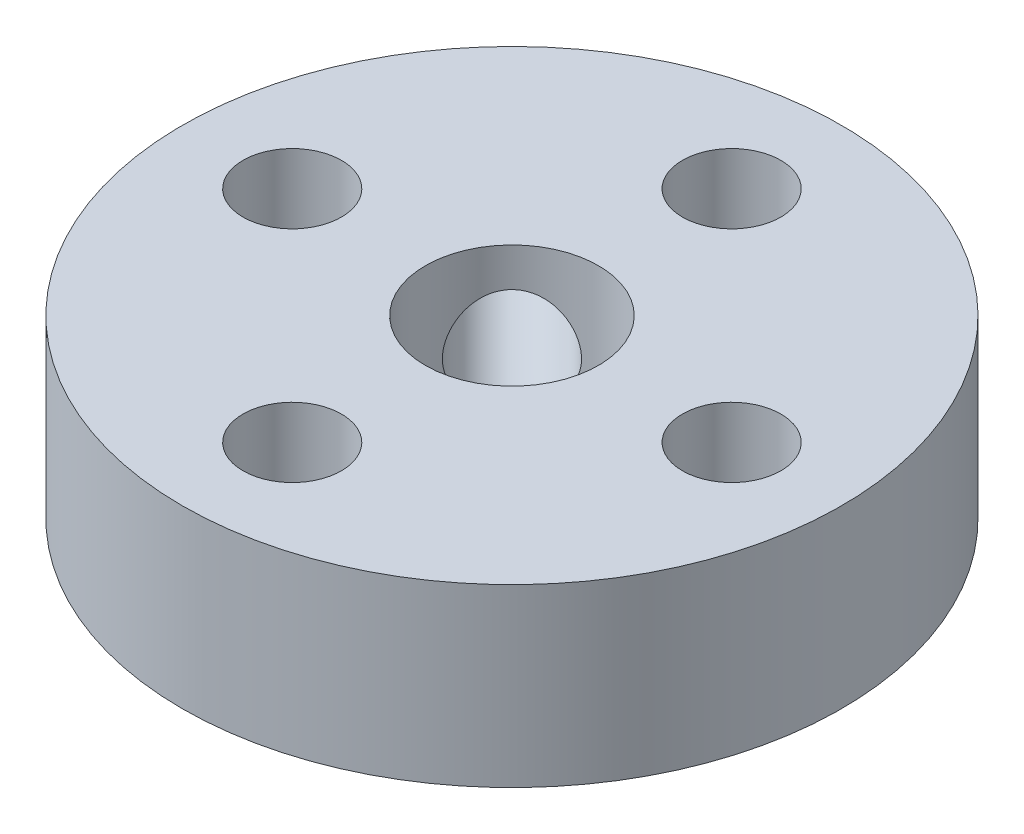
ISO-10303-21;
HEADER;
FILE_DESCRIPTION(('STEP AP214'),'2;1');
FILE_NAME('part.step','',(''),(''),'','','');
FILE_SCHEMA(('AUTOMOTIVE_DESIGN { 1 0 10303 214 1 1 1 1 }'));
ENDSEC;
DATA;
#1=APPLICATION_CONTEXT('core data for automotive mechanical design processes');
#2=APPLICATION_PROTOCOL_DEFINITION('international standard','automotive_design',2000,#1);
#3=PRODUCT_CONTEXT('',#1,'mechanical');
#4=PRODUCT('Part','Part','',(#3));
#5=PRODUCT_RELATED_PRODUCT_CATEGORY('part','',(#4));
#6=PRODUCT_DEFINITION_FORMATION('','',#4);
#7=PRODUCT_DEFINITION_CONTEXT('part definition',#1,'design');
#8=PRODUCT_DEFINITION('design','',#6,#7);
#9=PRODUCT_DEFINITION_SHAPE('','',#8);
#10=(LENGTH_UNIT() NAMED_UNIT(*) SI_UNIT(.MILLI.,.METRE.));
#11=(NAMED_UNIT(*) PLANE_ANGLE_UNIT() SI_UNIT($,.RADIAN.));
#12=(NAMED_UNIT(*) SI_UNIT($,.STERADIAN.) SOLID_ANGLE_UNIT());
#13=UNCERTAINTY_MEASURE_WITH_UNIT(LENGTH_MEASURE(1.E-05),#10,'distance_accuracy_value','');
#14=(GEOMETRIC_REPRESENTATION_CONTEXT(3) GLOBAL_UNCERTAINTY_ASSIGNED_CONTEXT((#13)) GLOBAL_UNIT_ASSIGNED_CONTEXT((#10,
#11,#12)) REPRESENTATION_CONTEXT('',''));
#15=CARTESIAN_POINT('',(0.,0.,0.));
#16=DIRECTION('',(0.,0.,1.));
#17=DIRECTION('',(1.,0.,0.));
#18=AXIS2_PLACEMENT_3D('',#15,#16,#17);
#19=CARTESIAN_POINT('',(0.,5.08,0.));
#20=DIRECTION('',(0.,1.,0.));
#21=DIRECTION('',(0.,0.,1.));
#22=AXIS2_PLACEMENT_3D('',#19,#20,#21);
#23=PLANE('',#22);
#24=CARTESIAN_POINT('',(0.,5.08,6.35));
#25=DIRECTION('',(0.,1.,0.));
#26=DIRECTION('',(0.,0.,1.));
#27=AXIS2_PLACEMENT_3D('',#24,#25,#26);
#28=CIRCLE('',#27,1.4224);
#29=CARTESIAN_POINT('',(0.,5.08,7.7724));
#30=VERTEX_POINT('',#29);
#31=EDGE_CURVE('E58',#30,#30,#28,.T.);
#32=ORIENTED_EDGE('',*,*,#31,.F.);
#33=EDGE_LOOP('',(#32));
#34=FACE_BOUND('',#33,.T.);
#35=CARTESIAN_POINT('',(0.,5.08,0.));
#36=DIRECTION('',(0.,1.,0.));
#37=DIRECTION('',(0.,0.,1.));
#38=AXIS2_PLACEMENT_3D('',#35,#36,#37);
#39=CIRCLE('',#38,2.5);
#40=CARTESIAN_POINT('',(0.,5.08,2.5));
#41=VERTEX_POINT('',#40);
#42=EDGE_CURVE('E46',#41,#41,#39,.T.);
#43=ORIENTED_EDGE('',*,*,#42,.F.);
#44=EDGE_LOOP('',(#43));
#45=FACE_BOUND('',#44,.T.);
#46=CARTESIAN_POINT('',(0.,5.08,0.));
#47=DIRECTION('',(0.,1.,0.));
#48=DIRECTION('',(0.,0.,1.));
#49=AXIS2_PLACEMENT_3D('',#46,#47,#48);
#50=CIRCLE('',#49,9.525);
#51=CARTESIAN_POINT('',(0.,5.08,9.525));
#52=VERTEX_POINT('',#51);
#53=EDGE_CURVE('E10',#52,#52,#50,.T.);
#54=ORIENTED_EDGE('',*,*,#53,.T.);
#55=EDGE_LOOP('',(#54));
#56=FACE_BOUND('',#55,.T.);
#57=CARTESIAN_POINT('',(0.,5.08,-6.35));
#58=DIRECTION('',(0.,1.,0.));
#59=DIRECTION('',(0.,0.,1.));
#60=AXIS2_PLACEMENT_3D('',#57,#58,#59);
#61=CIRCLE('',#60,1.4224);
#62=CARTESIAN_POINT('',(0.,5.08,-4.9276));
#63=VERTEX_POINT('',#62);
#64=EDGE_CURVE('E41',#63,#63,#61,.T.);
#65=ORIENTED_EDGE('',*,*,#64,.F.);
#66=EDGE_LOOP('',(#65));
#67=FACE_BOUND('',#66,.T.);
#68=CARTESIAN_POINT('',(6.35,5.08,0.));
#69=DIRECTION('',(0.,1.,0.));
#70=DIRECTION('',(0.,0.,1.));
#71=AXIS2_PLACEMENT_3D('',#68,#69,#70);
#72=CIRCLE('',#71,1.4224);
#73=CARTESIAN_POINT('',(6.35,5.08,1.4224));
#74=VERTEX_POINT('',#73);
#75=EDGE_CURVE('E52',#74,#74,#72,.T.);
#76=ORIENTED_EDGE('',*,*,#75,.F.);
#77=EDGE_LOOP('',(#76));
#78=FACE_BOUND('',#77,.T.);
#79=CARTESIAN_POINT('',(-6.35,5.08,0.));
#80=DIRECTION('',(0.,1.,0.));
#81=DIRECTION('',(0.,0.,1.));
#82=AXIS2_PLACEMENT_3D('',#79,#80,#81);
#83=CIRCLE('',#82,1.4224);
#84=CARTESIAN_POINT('',(-6.35,5.08,1.4224));
#85=VERTEX_POINT('',#84);
#86=EDGE_CURVE('E64',#85,#85,#83,.T.);
#87=ORIENTED_EDGE('',*,*,#86,.F.);
#88=EDGE_LOOP('',(#87));
#89=FACE_BOUND('',#88,.T.);
#90=ADVANCED_FACE('F30',(#34,#45,#56,#67,#78,#89),#23,.T.);
#91=CARTESIAN_POINT('',(0.,0.,0.));
#92=DIRECTION('',(0.,1.,0.));
#93=DIRECTION('',(0.,0.,1.));
#94=AXIS2_PLACEMENT_3D('',#91,#92,#93);
#95=PLANE('',#94);
#96=CARTESIAN_POINT('',(0.,0.,6.35));
#97=DIRECTION('',(0.,1.,0.));
#98=DIRECTION('',(0.,0.,1.));
#99=AXIS2_PLACEMENT_3D('',#96,#97,#98);
#100=CIRCLE('',#99,1.4224);
#101=CARTESIAN_POINT('',(0.,0.,7.7724));
#102=VERTEX_POINT('',#101);
#103=EDGE_CURVE('E61',#102,#102,#100,.T.);
#104=ORIENTED_EDGE('',*,*,#103,.T.);
#105=EDGE_LOOP('',(#104));
#106=FACE_BOUND('',#105,.T.);
#107=CARTESIAN_POINT('',(0.,0.,0.));
#108=DIRECTION('',(0.,1.,0.));
#109=DIRECTION('',(0.,0.,1.));
#110=AXIS2_PLACEMENT_3D('',#107,#108,#109);
#111=CIRCLE('',#110,2.5);
#112=CARTESIAN_POINT('',(0.,0.,2.5));
#113=VERTEX_POINT('',#112);
#114=EDGE_CURVE('E49',#113,#113,#111,.T.);
#115=ORIENTED_EDGE('',*,*,#114,.T.);
#116=EDGE_LOOP('',(#115));
#117=FACE_BOUND('',#116,.T.);
#118=CARTESIAN_POINT('',(0.,0.,0.));
#119=DIRECTION('',(0.,1.,0.));
#120=DIRECTION('',(0.,0.,1.));
#121=AXIS2_PLACEMENT_3D('',#118,#119,#120);
#122=CIRCLE('',#121,9.525);
#123=CARTESIAN_POINT('',(0.,0.,9.525));
#124=VERTEX_POINT('',#123);
#125=EDGE_CURVE('E34',#124,#124,#122,.T.);
#126=ORIENTED_EDGE('',*,*,#125,.F.);
#127=EDGE_LOOP('',(#126));
#128=FACE_BOUND('',#127,.T.);
#129=CARTESIAN_POINT('',(0.,0.,-6.35));
#130=DIRECTION('',(0.,1.,0.));
#131=DIRECTION('',(0.,0.,1.));
#132=AXIS2_PLACEMENT_3D('',#129,#130,#131);
#133=CIRCLE('',#132,1.4224);
#134=CARTESIAN_POINT('',(0.,0.,-4.9276));
#135=VERTEX_POINT('',#134);
#136=EDGE_CURVE('E43',#135,#135,#133,.T.);
#137=ORIENTED_EDGE('',*,*,#136,.T.);
#138=EDGE_LOOP('',(#137));
#139=FACE_BOUND('',#138,.T.);
#140=CARTESIAN_POINT('',(6.35,0.,0.));
#141=DIRECTION('',(0.,1.,0.));
#142=DIRECTION('',(0.,0.,1.));
#143=AXIS2_PLACEMENT_3D('',#140,#141,#142);
#144=CIRCLE('',#143,1.4224);
#145=CARTESIAN_POINT('',(6.35,0.,1.4224));
#146=VERTEX_POINT('',#145);
#147=EDGE_CURVE('E55',#146,#146,#144,.T.);
#148=ORIENTED_EDGE('',*,*,#147,.T.);
#149=EDGE_LOOP('',(#148));
#150=FACE_BOUND('',#149,.T.);
#151=CARTESIAN_POINT('',(-6.35,0.,0.));
#152=DIRECTION('',(0.,1.,0.));
#153=DIRECTION('',(0.,0.,1.));
#154=AXIS2_PLACEMENT_3D('',#151,#152,#153);
#155=CIRCLE('',#154,1.4224);
#156=CARTESIAN_POINT('',(-6.35,0.,1.4224));
#157=VERTEX_POINT('',#156);
#158=EDGE_CURVE('E67',#157,#157,#155,.T.);
#159=ORIENTED_EDGE('',*,*,#158,.T.);
#160=EDGE_LOOP('',(#159));
#161=FACE_BOUND('',#160,.T.);
#162=ADVANCED_FACE('F112',(#106,#117,#128,#139,#150,#161),#95,.F.);
#163=CARTESIAN_POINT('',(0.,5.08,0.));
#164=DIRECTION('',(0.,-1.,0.));
#165=DIRECTION('',(0.,0.,-1.));
#166=AXIS2_PLACEMENT_3D('',#163,#164,#165);
#167=CYLINDRICAL_SURFACE('',#166,9.525);
#168=CARTESIAN_POINT('',(-5.65388109754513,2.54,-7.6654584686646));
#169=CARTESIAN_POINT('',(-5.65388435472347,2.46058256470027,-7.66545708262193));
#170=CARTESIAN_POINT('',(-5.65931810554287,2.38111892661189,-7.66145742729927));
#171=CARTESIAN_POINT('',(-5.68084420001452,2.22441307389057,-7.64550892574785));
#172=CARTESIAN_POINT('',(-5.6969469614094,2.14717310755569,-7.63355230990403));
#173=CARTESIAN_POINT('',(-5.73914224001886,1.99720557814274,-7.60187888792083));
#174=CARTESIAN_POINT('',(-5.76522711616509,1.9244746128945,-7.58216801715423));
#175=CARTESIAN_POINT('',(-5.82636058679554,1.78548904334135,-7.5352919059718));
#176=CARTESIAN_POINT('',(-5.86140793863027,1.71923354297043,-7.50812769892484));
#177=CARTESIAN_POINT('',(-5.93943790162251,1.59454348588115,-7.44655509537823));
#178=CARTESIAN_POINT('',(-5.98247506331266,1.53616777062434,-7.41209665575615));
#179=CARTESIAN_POINT('',(-6.07476840048441,1.429404218033,-7.33664498745468));
#180=CARTESIAN_POINT('',(-6.12402491669996,1.38101692830799,-7.29565140070796));
#181=CARTESIAN_POINT('',(-6.22730049531981,1.29538683038543,-7.20770202538889));
#182=CARTESIAN_POINT('',(-6.28134111682068,1.25819818088579,-7.1607187785299));
#183=CARTESIAN_POINT('',(-6.39216124837026,1.19636854939226,-7.061968653933));
#184=CARTESIAN_POINT('',(-6.44894061478814,1.17172691016409,-7.01020202692476));
#185=CARTESIAN_POINT('',(-6.56297091290707,1.13586908572397,-6.90355586868091));
#186=CARTESIAN_POINT('',(-6.62021519401634,1.12455438703647,-6.84870236057311));
#187=CARTESIAN_POINT('',(-6.73384043918585,1.1153657521053,-6.73701433548634));
#188=CARTESIAN_POINT('',(-6.79022145066131,1.11749107499255,-6.68017992787442));
#189=CARTESIAN_POINT('',(-6.90007133472121,1.1350443750235,-6.56664549564057));
#190=CARTESIAN_POINT('',(-6.95355980957797,1.15036636784208,-6.50994800016963));
#191=CARTESIAN_POINT('',(-7.05673160870168,1.19371173084344,-6.39796563355996));
#192=CARTESIAN_POINT('',(-7.10641483570105,1.22173542557335,-6.34268079855491));
#193=CARTESIAN_POINT('',(-7.20100897164501,1.28979732420776,-6.23508228202828));
#194=CARTESIAN_POINT('',(-7.2459012887568,1.32988018148586,-6.18278051778109));
#195=CARTESIAN_POINT('',(-7.3297807116458,1.42089000144185,-6.0831069032811));
#196=CARTESIAN_POINT('',(-7.36876743182229,1.47181767170034,-6.03573537500683));
#197=CARTESIAN_POINT('',(-7.44047103622144,1.58366197102991,-5.94712557036153));
#198=CARTESIAN_POINT('',(-7.47312310132353,1.64467112816136,-5.90595157842873));
#199=CARTESIAN_POINT('',(-7.53112568403314,1.7746321082295,-5.83180878682334));
#200=CARTESIAN_POINT('',(-7.55647615742985,1.84358397925543,-5.7988400368333));
#201=CARTESIAN_POINT('',(-7.59948776016578,1.98756785718878,-5.74235824320182));
#202=CARTESIAN_POINT('',(-7.61714297592293,2.06260448772484,-5.71885247264077));
#203=CARTESIAN_POINT('',(-7.64445840664945,2.21657651410154,-5.68228884089613));
#204=CARTESIAN_POINT('',(-7.65411917983144,2.29551163732169,-5.66923025023945));
#205=CARTESIAN_POINT('',(-7.66524340011572,2.45422792126141,-5.65418046059149));
#206=CARTESIAN_POINT('',(-7.66678470549158,2.53399366935653,-5.65208414483721));
#207=CARTESIAN_POINT('',(-7.66185631873619,2.69281719573255,-5.6587630544383));
#208=CARTESIAN_POINT('',(-7.65538687289657,2.77187499570415,-5.66753794555693));
#209=CARTESIAN_POINT('',(-7.63458852567626,2.92663800729933,-5.69552292549072));
#210=CARTESIAN_POINT('',(-7.62029875317482,3.00235789854076,-5.71468105735));
#211=CARTESIAN_POINT('',(-7.58410228681576,3.14875853039957,-5.76263086759876));
#212=CARTESIAN_POINT('',(-7.56219521986002,3.21943902398085,-5.79142301786369));
#213=CARTESIAN_POINT('',(-7.5109080247252,3.35433464109158,-5.85778547787035));
#214=CARTESIAN_POINT('',(-7.48147333111853,3.41849756206204,-5.89541971188876));
#215=CARTESIAN_POINT('',(-7.41568915011372,3.53800016691851,-5.97795596693647));
#216=CARTESIAN_POINT('',(-7.37933927528284,3.59333935612309,-6.02285839515551));
#217=CARTESIAN_POINT('',(-7.30003589055511,3.69408798579376,-6.11874137087104));
#218=CARTESIAN_POINT('',(-7.25703035456742,3.73941170289045,-6.16976902460582));
#219=CARTESIAN_POINT('',(-7.16549688407367,3.8182456863416,-6.27584096659405));
#220=CARTESIAN_POINT('',(-7.11696909959924,3.85175627354066,-6.33088514570965));
#221=CARTESIAN_POINT('',(-7.01567285386339,3.90587565286399,-6.44295263031699));
#222=CARTESIAN_POINT('',(-6.96292062740725,3.9265313925195,-6.49996792174714));
#223=CARTESIAN_POINT('',(-6.85435466080989,3.95450669387101,-6.6143526329188));
#224=CARTESIAN_POINT('',(-6.79854112124344,3.96182712821284,-6.67172202924158));
#225=CARTESIAN_POINT('',(-6.68595844711062,3.96290286418783,-6.78453198045786));
#226=CARTESIAN_POINT('',(-6.6292038788828,3.95678935873627,-6.8399858654271));
#227=CARTESIAN_POINT('',(-6.51588787557537,3.93145186397896,-6.94801844147416));
#228=CARTESIAN_POINT('',(-6.45932643989427,3.91222791554106,-7.00059714151394));
#229=CARTESIAN_POINT('',(-6.34819355907892,3.86126162374855,-7.10152792783533));
#230=CARTESIAN_POINT('',(-6.29362071334938,3.82952828469606,-7.14988302376618));
#231=CARTESIAN_POINT('',(-6.18817918444125,3.75445798682541,-7.24133552485989));
#232=CARTESIAN_POINT('',(-6.13731061943922,3.71112065801476,-7.28443276231246));
#233=CARTESIAN_POINT('',(-6.04052759838355,3.61359786928615,-7.36489339274939));
#234=CARTESIAN_POINT('',(-5.99466346784344,3.55931552081251,-7.40219989669009));
#235=CARTESIAN_POINT('',(-5.91004934640318,3.44164738090554,-7.46993219035055));
#236=CARTESIAN_POINT('',(-5.87130102804818,3.37825945546418,-7.50035636279248));
#237=CARTESIAN_POINT('',(-5.80217406451433,3.24376490109082,-7.55396127002793));
#238=CARTESIAN_POINT('',(-5.77184320548808,3.17261727354405,-7.57710074519675));
#239=CARTESIAN_POINT('',(-5.72105915175497,3.02493925670086,-7.61551902360322));
#240=CARTESIAN_POINT('',(-5.70059569261841,2.94841455621691,-7.63080599638626));
#241=CARTESIAN_POINT('',(-5.67500892927038,2.8162872247469,-7.64984058894181));
#242=CARTESIAN_POINT('',(-5.66710198416781,2.76150117462201,-7.65569223823647));
#243=CARTESIAN_POINT('',(-5.65653696195574,2.65115095468021,-7.66350163827485));
#244=CARTESIAN_POINT('',(-5.65387881774218,2.59558679482031,-7.66545943880005));
#245=CARTESIAN_POINT('',(-5.65388109754513,2.54,-7.6654584686646));
#246=B_SPLINE_CURVE_WITH_KNOTS('',3,(#168,#169,#170,#171,#172,#173,#174,#175,#176,#177,#178,
#179,#180,#181,#182,#183,#184,#185,#186,#187,#188,#189,#190,#191,#192,#193,#194,#195,#196,#197,
#198,#199,#200,#201,#202,#203,#204,#205,#206,#207,#208,#209,#210,#211,#212,#213,#214,#215,#216,
#217,#218,#219,#220,#221,#222,#223,#224,#225,#226,#227,#228,#229,#230,#231,#232,#233,#234,#235,
#236,#237,#238,#239,#240,#241,#242,#243,#244,#245),.UNSPECIFIED.,.T.,.F.,(4,2,2,2,2,2,2,2,2,2,2,
2,2,2,2,2,2,2,2,2,2,2,2,2,2,2,2,2,2,2,2,2,2,2,2,2,2,2,4),(0.,0.238049132888686,
0.476331051809545,0.714430935341687,0.95249782414779,1.19225424938739,1.43202381564187,
1.67293498721233,1.91383353813675,2.15293994955475,2.39203318056215,2.6292239369987,
2.866420754349,3.10450692005875,3.34260862469923,3.58303121283165,3.8234552566814,
4.06406373507135,4.30465541153622,4.54293577788965,4.7812088184625,5.01830042106095,
5.25540363813694,5.49427682487896,5.73316339877006,5.97402158925002,6.21487323751799,
6.45484002211751,6.69479110302441,6.9324092972439,7.17002675076419,7.40747347782713,
7.64492777676627,7.88458447048563,8.12429742272042,8.36534462037958,8.60614052809323,
8.77276083548217,8.93937901267584),.UNSPECIFIED.);
#247=CARTESIAN_POINT('',(-5.65388109754513,2.54,-7.6654584686646));
#248=VERTEX_POINT('',#247);
#249=EDGE_CURVE('E70',#248,#248,#246,.T.);
#250=ORIENTED_EDGE('',*,*,#249,.F.);
#251=EDGE_LOOP('',(#250));
#252=FACE_BOUND('',#251,.T.);
#253=ORIENTED_EDGE('',*,*,#53,.F.);
#254=EDGE_LOOP('',(#253));
#255=FACE_BOUND('',#254,.T.);
#256=ORIENTED_EDGE('',*,*,#125,.T.);
#257=EDGE_LOOP('',(#256));
#258=FACE_BOUND('',#257,.T.);
#259=ADVANCED_FACE('F32',(#252,#255,#258),#167,.T.);
#260=CARTESIAN_POINT('',(0.,5.08,-6.35));
#261=DIRECTION('',(0.,-1.,0.));
#262=DIRECTION('',(0.,0.,-1.));
#263=AXIS2_PLACEMENT_3D('',#260,#261,#262);
#264=CYLINDRICAL_SURFACE('',#263,1.4224);
#265=ORIENTED_EDGE('',*,*,#64,.T.);
#266=EDGE_LOOP('',(#265));
#267=FACE_BOUND('',#266,.T.);
#268=ORIENTED_EDGE('',*,*,#136,.F.);
#269=EDGE_LOOP('',(#268));
#270=FACE_BOUND('',#269,.T.);
#271=ADVANCED_FACE('F106',(#267,#270),#264,.F.);
#272=CARTESIAN_POINT('',(0.,5.08,0.));
#273=DIRECTION('',(0.,-1.,0.));
#274=DIRECTION('',(0.,0.,-1.));
#275=AXIS2_PLACEMENT_3D('',#272,#273,#274);
#276=CYLINDRICAL_SURFACE('',#275,2.5);
#277=CARTESIAN_POINT('',(-0.447961334216701,2.54,-2.45953870533618));
#278=CARTESIAN_POINT('',(-0.447964519880176,2.46756243486401,-2.4595393842166));
#279=CARTESIAN_POINT('',(-0.454646582925861,2.39511201444241,-2.45834939105624));
#280=CARTESIAN_POINT('',(-0.48066243586206,2.25258892082213,-2.45339134088807));
#281=CARTESIAN_POINT('',(-0.500009857799643,2.1825188952792,-2.44962050585542));
#282=CARTESIAN_POINT('',(-0.549421183491684,2.04708928492822,-2.43900860830991));
#283=CARTESIAN_POINT('',(-0.579416079169487,1.98170255210592,-2.43218724450125));
#284=CARTESIAN_POINT('',(-0.648111099823981,1.85624998441668,-2.41478882704501));
#285=CARTESIAN_POINT('',(-0.686814003135166,1.79618585629801,-2.40421057411819));
#286=CARTESIAN_POINT('',(-0.775623681581913,1.67590954024535,-2.37713841815022));
#287=CARTESIAN_POINT('',(-0.826512892553673,1.61639154709153,-2.36012630816867));
#288=CARTESIAN_POINT('',(-0.934423709086805,1.50568866390753,-2.31952135965553));
#289=CARTESIAN_POINT('',(-0.991449219581232,1.45450913288995,-2.29592431529642));
#290=CARTESIAN_POINT('',(-1.11506799390468,1.35720112095303,-2.23867833679524));
#291=CARTESIAN_POINT('',(-1.1820569875944,1.31199659717902,-2.20429420301385));
#292=CARTESIAN_POINT('',(-1.31789370237312,1.23461392229919,-2.12586128823192));
#293=CARTESIAN_POINT('',(-1.38673985140599,1.20242510117171,-2.08182046946579));
#294=CARTESIAN_POINT('',(-1.51707679051211,1.15498008596725,-1.9885484142137));
#295=CARTESIAN_POINT('',(-1.57868262669907,1.13848527314577,-1.94011248316689));
#296=CARTESIAN_POINT('',(-1.69815664491716,1.11874445303254,-1.83643679069303));
#297=CARTESIAN_POINT('',(-1.75602785621305,1.11548757167953,-1.78120265197663));
#298=CARTESIAN_POINT('',(-1.85963399531828,1.12200912304123,-1.67235561758963));
#299=CARTESIAN_POINT('',(-1.90600237773038,1.13037037078065,-1.61925232729117));
#300=CARTESIAN_POINT('',(-1.99295748582573,1.15724959468792,-1.51094127417405));
#301=CARTESIAN_POINT('',(-2.03354378618665,1.17576831754078,-1.45573335692004));
#302=CARTESIAN_POINT('',(-2.10875119933762,1.22237721342965,-1.34451533333159));
#303=CARTESIAN_POINT('',(-2.14331455457461,1.25055310930409,-1.28850250228645));
#304=CARTESIAN_POINT('',(-2.20604043186084,1.31546190160877,-1.17789389851505));
#305=CARTESIAN_POINT('',(-2.2342010431947,1.35219734578602,-1.12329855309099));
#306=CARTESIAN_POINT('',(-2.28733452671982,1.43786981759939,-1.01112394674269));
#307=CARTESIAN_POINT('',(-2.31159275769191,1.48771443031577,-0.953899589638106));
#308=CARTESIAN_POINT('',(-2.35352125171077,1.59583134313704,-0.845186653442119));
#309=CARTESIAN_POINT('',(-2.3711835302802,1.65411373966918,-0.793705078556815));
#310=CARTESIAN_POINT('',(-2.40234638103512,1.78429938795028,-0.694056823394234));
#311=CARTESIAN_POINT('',(-2.41526739694491,1.85697833437955,-0.646713091777843));
#312=CARTESIAN_POINT('',(-2.43565714594682,2.01001663540936,-0.565116526940381));
#313=CARTESIAN_POINT('',(-2.44313550632761,2.0903621426966,-0.530840629971463));
#314=CARTESIAN_POINT('',(-2.45263276162631,2.23763987685275,-0.484781847358366));
#315=CARTESIAN_POINT('',(-2.45550591160316,2.30347334060054,-0.469658214009075));
#316=CARTESIAN_POINT('',(-2.45908258175534,2.43677681253061,-0.450569980092997));
#317=CARTESIAN_POINT('',(-2.45978814712475,2.50424521745437,-0.446594860810662));
#318=CARTESIAN_POINT('',(-2.4591365165999,2.63889320676676,-0.450166061120971));
#319=CARTESIAN_POINT('',(-2.45777822088901,2.70607261801828,-0.457718523688266));
#320=CARTESIAN_POINT('',(-2.4528038993387,2.83822982112714,-0.483654533182317));
#321=CARTESIAN_POINT('',(-2.44918624166989,2.90320598589267,-0.502045907997074));
#322=CARTESIAN_POINT('',(-2.43919676865282,3.0303216821344,-0.548530833956456));
#323=CARTESIAN_POINT('',(-2.4327883234156,3.09241089025372,-0.576752387172194));
#324=CARTESIAN_POINT('',(-2.41662472827079,3.21184941106322,-0.641111750023691));
#325=CARTESIAN_POINT('',(-2.4068682039231,3.2691967651295,-0.677252808537411));
#326=CARTESIAN_POINT('',(-2.38141717963018,3.3875286533238,-0.762319209760675));
#327=CARTESIAN_POINT('',(-2.36500865612187,3.44755272090902,-0.812369980787745));
#328=CARTESIAN_POINT('',(-2.32574484253378,3.55941873394572,-0.918765954780027));
#329=CARTESIAN_POINT('',(-2.30288428732092,3.61125394283031,-0.975116275671912));
#330=CARTESIAN_POINT('',(-2.24721280145557,3.71029315294429,-1.09772100062666));
#331=CARTESIAN_POINT('',(-2.21364908215952,3.75655300003873,-1.16440538337389));
#332=CARTESIAN_POINT('',(-2.13689090604032,3.83620382963469,-1.29990016556671));
#333=CARTESIAN_POINT('',(-2.09370416962718,3.86960507014265,-1.368708822826));
#334=CARTESIAN_POINT('',(-2.00172056720447,3.91965770356417,-1.49966056670165));
#335=CARTESIAN_POINT('',(-1.95367337723867,3.93745733466998,-1.56188783061297));
#336=CARTESIAN_POINT('',(-1.85055003319915,3.95969319909686,-1.68278230319214));
#337=CARTESIAN_POINT('',(-1.79548000090369,3.96414098926336,-1.74145254755068));
#338=CARTESIAN_POINT('',(-1.68688086044074,3.95969389336302,-1.84647772329837));
#339=CARTESIAN_POINT('',(-1.63390211152633,3.95227377811643,-1.89347307941684));
#340=CARTESIAN_POINT('',(-1.52566389776139,3.9271590265829,-1.98172273927315));
#341=CARTESIAN_POINT('',(-1.4704043071692,3.90946382313081,-2.02297672594258));
#342=CARTESIAN_POINT('',(-1.3592655268136,3.86451124387273,-2.09927614207773));
#343=CARTESIAN_POINT('',(-1.30338497793961,3.83722541785506,-2.13430262718729));
#344=CARTESIAN_POINT('',(-1.19288466769878,3.77406330612637,-2.19797597187725));
#345=CARTESIAN_POINT('',(-1.13826526239498,3.73818462610952,-2.22662104904583));
#346=CARTESIAN_POINT('',(-1.02601210708621,3.65439323770834,-2.28070024448826));
#347=CARTESIAN_POINT('',(-0.968706037908846,3.60559167280832,-2.30543628173501));
#348=CARTESIAN_POINT('',(-0.859582197907165,3.4995695886225,-2.34831082744165));
#349=CARTESIAN_POINT('',(-0.807771101952201,3.4423390274355,-2.36644137568534));
#350=CARTESIAN_POINT('',(-0.706903322474297,3.31409992416611,-2.39861763662278));
#351=CARTESIAN_POINT('',(-0.658674651333052,3.24228021260891,-2.41205338535605));
#352=CARTESIAN_POINT('',(-0.574949969021612,3.09084633402874,-2.4333743821077));
#353=CARTESIAN_POINT('',(-0.539432163153791,3.01124580974732,-2.44126915353374));
#354=CARTESIAN_POINT('',(-0.491250700124246,2.86627029583292,-2.45135159975514));
#355=CARTESIAN_POINT('',(-0.475139119790668,2.80210285098575,-2.45445713896745));
#356=CARTESIAN_POINT('',(-0.453497534252976,2.67195942355252,-2.45854947179205));
#357=CARTESIAN_POINT('',(-0.44795843232252,2.60598504531047,-2.45953808692838));
#358=CARTESIAN_POINT('',(-0.447961334216701,2.54,-2.45953870533618));
#359=B_SPLINE_CURVE_WITH_KNOTS('',3,(#277,#278,#279,#280,#281,#282,#283,#284,#285,#286,#287,
#288,#289,#290,#291,#292,#293,#294,#295,#296,#297,#298,#299,#300,#301,#302,#303,#304,#305,#306,
#307,#308,#309,#310,#311,#312,#313,#314,#315,#316,#317,#318,#319,#320,#321,#322,#323,#324,#325,
#326,#327,#328,#329,#330,#331,#332,#333,#334,#335,#336,#337,#338,#339,#340,#341,#342,#343,#344,
#345,#346,#347,#348,#349,#350,#351,#352,#353,#354,#355,#356,#357,#358),.UNSPECIFIED.,.T.,.F.,(4,
2,2,2,2,2,2,2,2,2,2,2,2,2,2,2,2,2,2,2,2,2,2,2,2,2,2,2,2,2,2,2,2,2,2,2,2,2,2,2,4),(0.,
0.217036901776442,0.434307790811994,0.650195476276879,0.866152139736711,1.10559315600049,
1.34518745574479,1.60725355230667,1.86910437445204,2.10796301000403,2.34662539971537,
2.55859475749605,2.77057969942126,2.98449728964091,3.19847863388965,3.43652417939541,
3.67485695488529,3.9366113445016,4.1979015947427,4.39983984628105,4.6015875032015,
4.80344270769965,5.00544387145535,5.21018026975502,5.41500081636887,5.65360763485817,
5.89240973249027,6.15449265179988,6.4163660579685,6.6567811607197,6.89698810921863,
7.1095871474532,7.32219792186196,7.53544479624405,7.74875115883329,7.98548241098653,
8.22249800955097,8.4838315270479,8.74471477724331,8.94258901739346,9.1402929265582),.UNSPECIFIED.);
#360=CARTESIAN_POINT('',(-0.447961334216701,2.54,-2.45953870533618));
#361=VERTEX_POINT('',#360);
#362=EDGE_CURVE('E79',#361,#361,#359,.T.);
#363=ORIENTED_EDGE('',*,*,#362,.T.);
#364=EDGE_LOOP('',(#363));
#365=FACE_BOUND('',#364,.T.);
#366=ORIENTED_EDGE('',*,*,#42,.T.);
#367=EDGE_LOOP('',(#366));
#368=FACE_BOUND('',#367,.T.);
#369=ORIENTED_EDGE('',*,*,#114,.F.);
#370=EDGE_LOOP('',(#369));
#371=FACE_BOUND('',#370,.T.);
#372=ADVANCED_FACE('F102',(#365,#368,#371),#276,.F.);
#373=CARTESIAN_POINT('',(6.35,5.08,0.));
#374=DIRECTION('',(0.,-1.,0.));
#375=DIRECTION('',(0.,0.,-1.));
#376=AXIS2_PLACEMENT_3D('',#373,#374,#375);
#377=CYLINDRICAL_SURFACE('',#376,1.4224);
#378=ORIENTED_EDGE('',*,*,#75,.T.);
#379=EDGE_LOOP('',(#378));
#380=FACE_BOUND('',#379,.T.);
#381=ORIENTED_EDGE('',*,*,#147,.F.);
#382=EDGE_LOOP('',(#381));
#383=FACE_BOUND('',#382,.T.);
#384=ADVANCED_FACE('F98',(#380,#383),#377,.F.);
#385=CARTESIAN_POINT('',(0.,5.08,6.35));
#386=DIRECTION('',(0.,-1.,0.));
#387=DIRECTION('',(0.,0.,-1.));
#388=AXIS2_PLACEMENT_3D('',#385,#386,#387);
#389=CYLINDRICAL_SURFACE('',#388,1.4224);
#390=ORIENTED_EDGE('',*,*,#31,.T.);
#391=EDGE_LOOP('',(#390));
#392=FACE_BOUND('',#391,.T.);
#393=ORIENTED_EDGE('',*,*,#103,.F.);
#394=EDGE_LOOP('',(#393));
#395=FACE_BOUND('',#394,.T.);
#396=ADVANCED_FACE('F94',(#392,#395),#389,.F.);
#397=CARTESIAN_POINT('',(-6.35,5.08,0.));
#398=DIRECTION('',(0.,-1.,0.));
#399=DIRECTION('',(0.,0.,-1.));
#400=AXIS2_PLACEMENT_3D('',#397,#398,#399);
#401=CYLINDRICAL_SURFACE('',#400,1.4224);
#402=ORIENTED_EDGE('',*,*,#86,.T.);
#403=EDGE_LOOP('',(#402));
#404=FACE_BOUND('',#403,.T.);
#405=ORIENTED_EDGE('',*,*,#158,.F.);
#406=EDGE_LOOP('',(#405));
#407=FACE_BOUND('',#406,.T.);
#408=ADVANCED_FACE('F89',(#404,#407),#401,.F.);
#409=CARTESIAN_POINT('',(-9.52600000000002,2.54,-9.52599999999998));
#410=DIRECTION('',(0.707106781186549,0.,0.707106781186546));
#411=DIRECTION('',(0.707106781186546,0.,-0.707106781186549));
#412=AXIS2_PLACEMENT_3D('',#409,#410,#411);
#413=CYLINDRICAL_SURFACE('',#412,1.4224);
#414=ORIENTED_EDGE('',*,*,#362,.F.);
#415=EDGE_LOOP('',(#414));
#416=FACE_BOUND('',#415,.T.);
#417=ORIENTED_EDGE('',*,*,#249,.T.);
#418=EDGE_LOOP('',(#417));
#419=FACE_BOUND('',#418,.T.);
#420=ADVANCED_FACE('F83',(#416,#419),#413,.F.);
#421=CLOSED_SHELL('',(#90,#162,#259,#271,#372,#384,#396,#408,#420));
#422=MANIFOLD_SOLID_BREP('B2',#421);
#423=ADVANCED_BREP_SHAPE_REPRESENTATION('',(#18,#422),#14);
#424=SHAPE_DEFINITION_REPRESENTATION(#9,#423);
ENDSEC;
END-ISO-10303-21;
